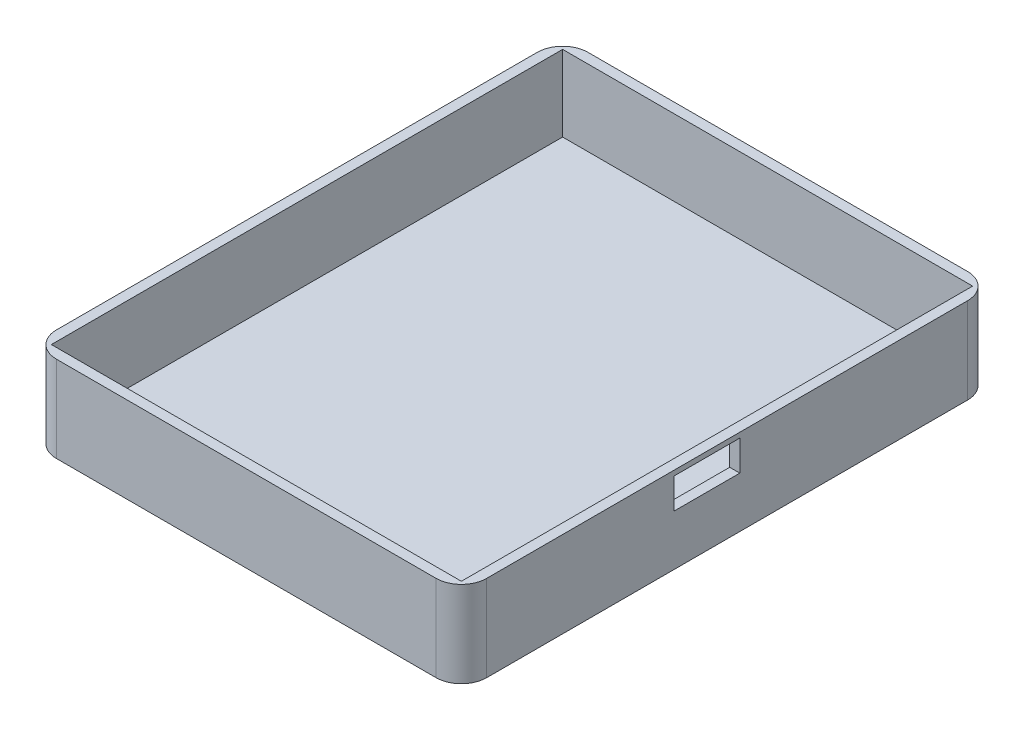
ISO-10303-21;
HEADER;
FILE_DESCRIPTION(('STEP AP214'),'2;1');
FILE_NAME('part.step','',(''),(''),'','','');
FILE_SCHEMA(('AUTOMOTIVE_DESIGN { 1 0 10303 214 1 1 1 1 }'));
ENDSEC;
DATA;
#1=APPLICATION_CONTEXT('core data for automotive mechanical design processes');
#2=APPLICATION_PROTOCOL_DEFINITION('international standard','automotive_design',2000,#1);
#3=PRODUCT_CONTEXT('',#1,'mechanical');
#4=PRODUCT('Part','Part','',(#3));
#5=PRODUCT_RELATED_PRODUCT_CATEGORY('part','',(#4));
#6=PRODUCT_DEFINITION_FORMATION('','',#4);
#7=PRODUCT_DEFINITION_CONTEXT('part definition',#1,'design');
#8=PRODUCT_DEFINITION('design','',#6,#7);
#9=PRODUCT_DEFINITION_SHAPE('','',#8);
#10=(LENGTH_UNIT() NAMED_UNIT(*) SI_UNIT(.MILLI.,.METRE.));
#11=(NAMED_UNIT(*) PLANE_ANGLE_UNIT() SI_UNIT($,.RADIAN.));
#12=(NAMED_UNIT(*) SI_UNIT($,.STERADIAN.) SOLID_ANGLE_UNIT());
#13=UNCERTAINTY_MEASURE_WITH_UNIT(LENGTH_MEASURE(1.E-05),#10,'distance_accuracy_value','');
#14=(GEOMETRIC_REPRESENTATION_CONTEXT(3) GLOBAL_UNCERTAINTY_ASSIGNED_CONTEXT((#13)) GLOBAL_UNIT_ASSIGNED_CONTEXT((#10,
#11,#12)) REPRESENTATION_CONTEXT('',''));
#15=CARTESIAN_POINT('',(0.,0.,0.));
#16=DIRECTION('',(0.,0.,1.));
#17=DIRECTION('',(1.,0.,0.));
#18=AXIS2_PLACEMENT_3D('',#15,#16,#17);
#19=CARTESIAN_POINT('',(0.,17.,0.));
#20=DIRECTION('',(0.,-1.,0.));
#21=DIRECTION('',(0.,0.,-1.));
#22=AXIS2_PLACEMENT_3D('',#19,#20,#21);
#23=PLANE('',#22);
#24=DIRECTION('',(-1.,0.,0.));
#25=VECTOR('',#24,1.);
#26=CARTESIAN_POINT('',(-42.5,17.,-52.5));
#27=LINE('',#26,#25);
#28=CARTESIAN_POINT('',(37.5,17.,-52.5));
#29=VERTEX_POINT('',#28);
#30=CARTESIAN_POINT('',(-37.5,17.,-52.5));
#31=VERTEX_POINT('',#30);
#32=EDGE_CURVE('E218',#29,#31,#27,.T.);
#33=ORIENTED_EDGE('',*,*,#32,.T.);
#34=CARTESIAN_POINT('',(-37.5,17.,-47.5));
#35=DIRECTION('',(0.,-1.,0.));
#36=DIRECTION('',(0.,0.,-1.));
#37=AXIS2_PLACEMENT_3D('',#34,#35,#36);
#38=CIRCLE('',#37,5.);
#39=CARTESIAN_POINT('',(-42.5,17.,-47.5));
#40=VERTEX_POINT('',#39);
#41=EDGE_CURVE('E265',#31,#40,#38,.F.);
#42=ORIENTED_EDGE('',*,*,#41,.T.);
#43=DIRECTION('',(0.,0.,1.));
#44=VECTOR('',#43,1.);
#45=CARTESIAN_POINT('',(-42.5,17.,52.5));
#46=LINE('',#45,#44);
#47=CARTESIAN_POINT('',(-42.5,17.,47.5));
#48=VERTEX_POINT('',#47);
#49=EDGE_CURVE('E222',#40,#48,#46,.T.);
#50=ORIENTED_EDGE('',*,*,#49,.T.);
#51=CARTESIAN_POINT('',(-37.5,17.,47.5));
#52=DIRECTION('',(0.,-1.,0.));
#53=DIRECTION('',(0.,0.,-1.));
#54=AXIS2_PLACEMENT_3D('',#51,#52,#53);
#55=CIRCLE('',#54,5.);
#56=CARTESIAN_POINT('',(-37.5,17.,52.5));
#57=VERTEX_POINT('',#56);
#58=EDGE_CURVE('E56',#48,#57,#55,.F.);
#59=ORIENTED_EDGE('',*,*,#58,.T.);
#60=DIRECTION('',(1.,0.,0.));
#61=VECTOR('',#60,1.);
#62=CARTESIAN_POINT('',(-42.5,17.,52.5));
#63=LINE('',#62,#61);
#64=CARTESIAN_POINT('',(37.5,17.,52.5));
#65=VERTEX_POINT('',#64);
#66=EDGE_CURVE('E224',#57,#65,#63,.T.);
#67=ORIENTED_EDGE('',*,*,#66,.T.);
#68=CARTESIAN_POINT('',(37.5,17.,47.5));
#69=DIRECTION('',(0.,-1.,0.));
#70=DIRECTION('',(0.,0.,-1.));
#71=AXIS2_PLACEMENT_3D('',#68,#69,#70);
#72=CIRCLE('',#71,5.);
#73=CARTESIAN_POINT('',(42.5,17.,47.5));
#74=VERTEX_POINT('',#73);
#75=EDGE_CURVE('E261',#65,#74,#72,.F.);
#76=ORIENTED_EDGE('',*,*,#75,.T.);
#77=DIRECTION('',(0.,0.,-1.));
#78=VECTOR('',#77,1.);
#79=CARTESIAN_POINT('',(42.5,17.,52.5));
#80=LINE('',#79,#78);
#81=CARTESIAN_POINT('',(42.5,17.,-47.5));
#82=VERTEX_POINT('',#81);
#83=EDGE_CURVE('E215',#74,#82,#80,.T.);
#84=ORIENTED_EDGE('',*,*,#83,.T.);
#85=CARTESIAN_POINT('',(37.5,17.,-47.5));
#86=DIRECTION('',(0.,-1.,0.));
#87=DIRECTION('',(0.,0.,-1.));
#88=AXIS2_PLACEMENT_3D('',#85,#86,#87);
#89=CIRCLE('',#88,5.);
#90=EDGE_CURVE('E263',#82,#29,#89,.F.);
#91=ORIENTED_EDGE('',*,*,#90,.T.);
#92=EDGE_LOOP('',(#33,#42,#50,#59,#67,#76,#84,#91));
#93=FACE_BOUND('',#92,.T.);
#94=DIRECTION('',(0.,0.,-1.));
#95=VECTOR('',#94,1.);
#96=CARTESIAN_POINT('',(40.5,17.,0.));
#97=LINE('',#96,#95);
#98=CARTESIAN_POINT('',(40.5,17.,50.5));
#99=VERTEX_POINT('',#98);
#100=CARTESIAN_POINT('',(40.5,17.,-50.5));
#101=VERTEX_POINT('',#100);
#102=EDGE_CURVE('E207',#99,#101,#97,.T.);
#103=ORIENTED_EDGE('',*,*,#102,.F.);
#104=DIRECTION('',(1.,0.,0.));
#105=VECTOR('',#104,1.);
#106=CARTESIAN_POINT('',(0.,17.,50.5));
#107=LINE('',#106,#105);
#108=CARTESIAN_POINT('',(-40.5,17.,50.5));
#109=VERTEX_POINT('',#108);
#110=EDGE_CURVE('E197',#109,#99,#107,.T.);
#111=ORIENTED_EDGE('',*,*,#110,.F.);
#112=DIRECTION('',(0.,0.,1.));
#113=VECTOR('',#112,1.);
#114=CARTESIAN_POINT('',(-40.5,17.,0.));
#115=LINE('',#114,#113);
#116=CARTESIAN_POINT('',(-40.5,17.,-50.5));
#117=VERTEX_POINT('',#116);
#118=EDGE_CURVE('E211',#117,#109,#115,.T.);
#119=ORIENTED_EDGE('',*,*,#118,.F.);
#120=DIRECTION('',(-1.,0.,0.));
#121=VECTOR('',#120,1.);
#122=CARTESIAN_POINT('',(0.,17.,-50.5));
#123=LINE('',#122,#121);
#124=EDGE_CURVE('E209',#101,#117,#123,.T.);
#125=ORIENTED_EDGE('',*,*,#124,.F.);
#126=EDGE_LOOP('',(#103,#111,#119,#125));
#127=FACE_BOUND('',#126,.T.);
#128=ADVANCED_FACE('F36',(#93,#127),#23,.F.);
#129=CARTESIAN_POINT('',(42.5,17.,52.5));
#130=DIRECTION('',(-1.,0.,0.));
#131=DIRECTION('',(0.,0.,1.));
#132=AXIS2_PLACEMENT_3D('',#129,#130,#131);
#133=PLANE('',#132);
#134=DIRECTION('',(0.,0.,1.));
#135=VECTOR('',#134,1.);
#136=CARTESIAN_POINT('',(42.5,16.,10.5));
#137=LINE('',#136,#135);
#138=CARTESIAN_POINT('',(42.5,16.,-2.5));
#139=VERTEX_POINT('',#138);
#140=CARTESIAN_POINT('',(42.5,16.,10.5));
#141=VERTEX_POINT('',#140);
#142=EDGE_CURVE('E165',#139,#141,#137,.T.);
#143=ORIENTED_EDGE('',*,*,#142,.F.);
#144=DIRECTION('',(0.,1.,0.));
#145=VECTOR('',#144,1.);
#146=CARTESIAN_POINT('',(42.5,10.,-2.5));
#147=LINE('',#146,#145);
#148=CARTESIAN_POINT('',(42.5,10.,-2.5));
#149=VERTEX_POINT('',#148);
#150=EDGE_CURVE('E170',#149,#139,#147,.T.);
#151=ORIENTED_EDGE('',*,*,#150,.F.);
#152=DIRECTION('',(0.,0.,-1.));
#153=VECTOR('',#152,1.);
#154=CARTESIAN_POINT('',(42.5,10.,10.5));
#155=LINE('',#154,#153);
#156=CARTESIAN_POINT('',(42.5,10.,10.5));
#157=VERTEX_POINT('',#156);
#158=EDGE_CURVE('E175',#157,#149,#155,.T.);
#159=ORIENTED_EDGE('',*,*,#158,.F.);
#160=DIRECTION('',(0.,-1.,0.));
#161=VECTOR('',#160,1.);
#162=CARTESIAN_POINT('',(42.5,10.,10.5));
#163=LINE('',#162,#161);
#164=EDGE_CURVE('E154',#141,#157,#163,.T.);
#165=ORIENTED_EDGE('',*,*,#164,.F.);
#166=EDGE_LOOP('',(#143,#151,#159,#165));
#167=FACE_BOUND('',#166,.T.);
#168=DIRECTION('',(0.,0.,-1.));
#169=VECTOR('',#168,1.);
#170=CARTESIAN_POINT('',(42.5,0.,52.5));
#171=LINE('',#170,#169);
#172=CARTESIAN_POINT('',(42.5,0.,47.5));
#173=VERTEX_POINT('',#172);
#174=CARTESIAN_POINT('',(42.5,0.,-47.5));
#175=VERTEX_POINT('',#174);
#176=EDGE_CURVE('E191',#173,#175,#171,.T.);
#177=ORIENTED_EDGE('',*,*,#176,.T.);
#178=DIRECTION('',(0.,-1.,0.));
#179=VECTOR('',#178,1.);
#180=CARTESIAN_POINT('',(42.5,17.,-47.5));
#181=LINE('',#180,#179);
#182=EDGE_CURVE('E270',#175,#82,#181,.F.);
#183=ORIENTED_EDGE('',*,*,#182,.T.);
#184=ORIENTED_EDGE('',*,*,#83,.F.);
#185=DIRECTION('',(0.,-1.,0.));
#186=VECTOR('',#185,1.);
#187=CARTESIAN_POINT('',(42.5,17.,47.5));
#188=LINE('',#187,#186);
#189=EDGE_CURVE('E267',#74,#173,#188,.T.);
#190=ORIENTED_EDGE('',*,*,#189,.T.);
#191=EDGE_LOOP('',(#177,#183,#184,#190));
#192=FACE_BOUND('',#191,.T.);
#193=ADVANCED_FACE('F172',(#167,#192),#133,.F.);
#194=CARTESIAN_POINT('',(-42.5,17.,-52.5));
#195=DIRECTION('',(0.,0.,1.));
#196=DIRECTION('',(1.,0.,0.));
#197=AXIS2_PLACEMENT_3D('',#194,#195,#196);
#198=PLANE('',#197);
#199=DIRECTION('',(-1.,0.,0.));
#200=VECTOR('',#199,1.);
#201=CARTESIAN_POINT('',(-42.5,0.,-52.5));
#202=LINE('',#201,#200);
#203=CARTESIAN_POINT('',(37.5,0.,-52.5));
#204=VERTEX_POINT('',#203);
#205=CARTESIAN_POINT('',(-37.5,0.,-52.5));
#206=VERTEX_POINT('',#205);
#207=EDGE_CURVE('E229',#204,#206,#202,.T.);
#208=ORIENTED_EDGE('',*,*,#207,.T.);
#209=DIRECTION('',(0.,-1.,0.));
#210=VECTOR('',#209,1.);
#211=CARTESIAN_POINT('',(-37.5,17.,-52.5));
#212=LINE('',#211,#210);
#213=EDGE_CURVE('E258',#206,#31,#212,.F.);
#214=ORIENTED_EDGE('',*,*,#213,.T.);
#215=ORIENTED_EDGE('',*,*,#32,.F.);
#216=DIRECTION('',(0.,-1.,0.));
#217=VECTOR('',#216,1.);
#218=CARTESIAN_POINT('',(37.5,17.,-52.5));
#219=LINE('',#218,#217);
#220=EDGE_CURVE('E255',#29,#204,#219,.T.);
#221=ORIENTED_EDGE('',*,*,#220,.T.);
#222=EDGE_LOOP('',(#208,#214,#215,#221));
#223=FACE_BOUND('',#222,.T.);
#224=ADVANCED_FACE('F294',(#223),#198,.F.);
#225=CARTESIAN_POINT('',(-42.5,17.,52.5));
#226=DIRECTION('',(1.,0.,0.));
#227=DIRECTION('',(0.,0.,-1.));
#228=AXIS2_PLACEMENT_3D('',#225,#226,#227);
#229=PLANE('',#228);
#230=ORIENTED_EDGE('',*,*,#49,.F.);
#231=DIRECTION('',(0.,-1.,0.));
#232=VECTOR('',#231,1.);
#233=CARTESIAN_POINT('',(-42.5,17.,-47.5));
#234=LINE('',#233,#232);
#235=CARTESIAN_POINT('',(-42.5,0.,-47.5));
#236=VERTEX_POINT('',#235);
#237=EDGE_CURVE('E244',#40,#236,#234,.T.);
#238=ORIENTED_EDGE('',*,*,#237,.T.);
#239=DIRECTION('',(0.,0.,1.));
#240=VECTOR('',#239,1.);
#241=CARTESIAN_POINT('',(-42.5,0.,52.5));
#242=LINE('',#241,#240);
#243=CARTESIAN_POINT('',(-42.5,0.,47.5));
#244=VERTEX_POINT('',#243);
#245=EDGE_CURVE('E232',#236,#244,#242,.T.);
#246=ORIENTED_EDGE('',*,*,#245,.T.);
#247=DIRECTION('',(0.,-1.,0.));
#248=VECTOR('',#247,1.);
#249=CARTESIAN_POINT('',(-42.5,17.,47.5));
#250=LINE('',#249,#248);
#251=EDGE_CURVE('E242',#244,#48,#250,.F.);
#252=ORIENTED_EDGE('',*,*,#251,.T.);
#253=EDGE_LOOP('',(#230,#238,#246,#252));
#254=FACE_BOUND('',#253,.T.);
#255=ADVANCED_FACE('F302',(#254),#229,.F.);
#256=CARTESIAN_POINT('',(-42.5,17.,52.5));
#257=DIRECTION('',(0.,0.,-1.));
#258=DIRECTION('',(-1.,0.,0.));
#259=AXIS2_PLACEMENT_3D('',#256,#257,#258);
#260=PLANE('',#259);
#261=DIRECTION('',(1.,0.,0.));
#262=VECTOR('',#261,1.);
#263=CARTESIAN_POINT('',(-42.5,0.,52.5));
#264=LINE('',#263,#262);
#265=CARTESIAN_POINT('',(-37.5,0.,52.5));
#266=VERTEX_POINT('',#265);
#267=CARTESIAN_POINT('',(37.5,0.,52.5));
#268=VERTEX_POINT('',#267);
#269=EDGE_CURVE('E219',#266,#268,#264,.T.);
#270=ORIENTED_EDGE('',*,*,#269,.T.);
#271=DIRECTION('',(0.,-1.,0.));
#272=VECTOR('',#271,1.);
#273=CARTESIAN_POINT('',(37.5,17.,52.5));
#274=LINE('',#273,#272);
#275=EDGE_CURVE('E11',#268,#65,#274,.F.);
#276=ORIENTED_EDGE('',*,*,#275,.T.);
#277=ORIENTED_EDGE('',*,*,#66,.F.);
#278=DIRECTION('',(0.,-1.,0.));
#279=VECTOR('',#278,1.);
#280=CARTESIAN_POINT('',(-37.5,17.,52.5));
#281=LINE('',#280,#279);
#282=EDGE_CURVE('E44',#57,#266,#281,.T.);
#283=ORIENTED_EDGE('',*,*,#282,.T.);
#284=EDGE_LOOP('',(#270,#276,#277,#283));
#285=FACE_BOUND('',#284,.T.);
#286=ADVANCED_FACE('F274',(#285),#260,.F.);
#287=CARTESIAN_POINT('',(0.,0.,0.));
#288=DIRECTION('',(0.,-1.,0.));
#289=DIRECTION('',(0.,0.,-1.));
#290=AXIS2_PLACEMENT_3D('',#287,#288,#289);
#291=PLANE('',#290);
#292=ORIENTED_EDGE('',*,*,#245,.F.);
#293=CARTESIAN_POINT('',(-37.5,0.,-47.5));
#294=DIRECTION('',(0.,-1.,0.));
#295=DIRECTION('',(0.,0.,-1.));
#296=AXIS2_PLACEMENT_3D('',#293,#294,#295);
#297=CIRCLE('',#296,5.);
#298=EDGE_CURVE('E253',#236,#206,#297,.T.);
#299=ORIENTED_EDGE('',*,*,#298,.T.);
#300=ORIENTED_EDGE('',*,*,#207,.F.);
#301=CARTESIAN_POINT('',(37.5,0.,-47.5));
#302=DIRECTION('',(0.,-1.,0.));
#303=DIRECTION('',(0.,0.,-1.));
#304=AXIS2_PLACEMENT_3D('',#301,#302,#303);
#305=CIRCLE('',#304,5.);
#306=EDGE_CURVE('E251',#204,#175,#305,.T.);
#307=ORIENTED_EDGE('',*,*,#306,.T.);
#308=ORIENTED_EDGE('',*,*,#176,.F.);
#309=CARTESIAN_POINT('',(37.5,0.,47.5));
#310=DIRECTION('',(0.,-1.,0.));
#311=DIRECTION('',(0.,0.,-1.));
#312=AXIS2_PLACEMENT_3D('',#309,#310,#311);
#313=CIRCLE('',#312,5.);
#314=EDGE_CURVE('E249',#173,#268,#313,.T.);
#315=ORIENTED_EDGE('',*,*,#314,.T.);
#316=ORIENTED_EDGE('',*,*,#269,.F.);
#317=CARTESIAN_POINT('',(-37.5,0.,47.5));
#318=DIRECTION('',(0.,-1.,0.));
#319=DIRECTION('',(0.,0.,-1.));
#320=AXIS2_PLACEMENT_3D('',#317,#318,#319);
#321=CIRCLE('',#320,5.);
#322=EDGE_CURVE('E247',#266,#244,#321,.T.);
#323=ORIENTED_EDGE('',*,*,#322,.T.);
#324=EDGE_LOOP('',(#292,#299,#300,#307,#308,#315,#316,#323));
#325=FACE_BOUND('',#324,.T.);
#326=ADVANCED_FACE('F278',(#325),#291,.T.);
#327=CARTESIAN_POINT('',(40.5,17.,52.5));
#328=DIRECTION('',(-1.,0.,0.));
#329=DIRECTION('',(0.,0.,1.));
#330=AXIS2_PLACEMENT_3D('',#327,#328,#329);
#331=PLANE('',#330);
#332=DIRECTION('',(0.,-1.,0.));
#333=VECTOR('',#332,1.);
#334=CARTESIAN_POINT('',(40.5,17.,-2.5));
#335=LINE('',#334,#333);
#336=CARTESIAN_POINT('',(40.5,16.,-2.5));
#337=VERTEX_POINT('',#336);
#338=CARTESIAN_POINT('',(40.5,10.,-2.5));
#339=VERTEX_POINT('',#338);
#340=EDGE_CURVE('E240',#337,#339,#335,.T.);
#341=ORIENTED_EDGE('',*,*,#340,.F.);
#342=DIRECTION('',(0.,0.,-1.));
#343=VECTOR('',#342,1.);
#344=CARTESIAN_POINT('',(40.5,16.,52.5));
#345=LINE('',#344,#343);
#346=CARTESIAN_POINT('',(40.5,16.,10.5));
#347=VERTEX_POINT('',#346);
#348=EDGE_CURVE('E226',#347,#337,#345,.T.);
#349=ORIENTED_EDGE('',*,*,#348,.F.);
#350=DIRECTION('',(0.,1.,0.));
#351=VECTOR('',#350,1.);
#352=CARTESIAN_POINT('',(40.5,17.,10.5));
#353=LINE('',#352,#351);
#354=CARTESIAN_POINT('',(40.5,10.,10.5));
#355=VERTEX_POINT('',#354);
#356=EDGE_CURVE('E157',#355,#347,#353,.T.);
#357=ORIENTED_EDGE('',*,*,#356,.F.);
#358=DIRECTION('',(0.,0.,1.));
#359=VECTOR('',#358,1.);
#360=CARTESIAN_POINT('',(40.5,10.,52.5));
#361=LINE('',#360,#359);
#362=EDGE_CURVE('E238',#339,#355,#361,.T.);
#363=ORIENTED_EDGE('',*,*,#362,.F.);
#364=EDGE_LOOP('',(#341,#349,#357,#363));
#365=FACE_BOUND('',#364,.T.);
#366=DIRECTION('',(0.,0.,-1.));
#367=VECTOR('',#366,1.);
#368=CARTESIAN_POINT('',(40.5,2.,0.));
#369=LINE('',#368,#367);
#370=CARTESIAN_POINT('',(40.5,2.,50.5));
#371=VERTEX_POINT('',#370);
#372=CARTESIAN_POINT('',(40.5,2.,-50.5));
#373=VERTEX_POINT('',#372);
#374=EDGE_CURVE('E182',#371,#373,#369,.T.);
#375=ORIENTED_EDGE('',*,*,#374,.F.);
#376=DIRECTION('',(0.,-1.,0.));
#377=VECTOR('',#376,1.);
#378=CARTESIAN_POINT('',(40.5,17.,50.5));
#379=LINE('',#378,#377);
#380=EDGE_CURVE('E193',#99,#371,#379,.T.);
#381=ORIENTED_EDGE('',*,*,#380,.F.);
#382=ORIENTED_EDGE('',*,*,#102,.T.);
#383=DIRECTION('',(0.,-1.,0.));
#384=VECTOR('',#383,1.);
#385=CARTESIAN_POINT('',(40.5,17.,-50.5));
#386=LINE('',#385,#384);
#387=EDGE_CURVE('E188',#101,#373,#386,.T.);
#388=ORIENTED_EDGE('',*,*,#387,.T.);
#389=EDGE_LOOP('',(#375,#381,#382,#388));
#390=FACE_BOUND('',#389,.T.);
#391=ADVANCED_FACE('F320',(#365,#390),#331,.T.);
#392=CARTESIAN_POINT('',(-42.5,17.,-50.5));
#393=DIRECTION('',(0.,0.,1.));
#394=DIRECTION('',(1.,0.,0.));
#395=AXIS2_PLACEMENT_3D('',#392,#393,#394);
#396=PLANE('',#395);
#397=DIRECTION('',(-1.,0.,0.));
#398=VECTOR('',#397,1.);
#399=CARTESIAN_POINT('',(0.,2.,-50.5));
#400=LINE('',#399,#398);
#401=CARTESIAN_POINT('',(-40.5,2.,-50.5));
#402=VERTEX_POINT('',#401);
#403=EDGE_CURVE('E187',#373,#402,#400,.T.);
#404=ORIENTED_EDGE('',*,*,#403,.F.);
#405=ORIENTED_EDGE('',*,*,#387,.F.);
#406=ORIENTED_EDGE('',*,*,#124,.T.);
#407=DIRECTION('',(0.,-1.,0.));
#408=VECTOR('',#407,1.);
#409=CARTESIAN_POINT('',(-40.5,17.,-50.5));
#410=LINE('',#409,#408);
#411=EDGE_CURVE('E192',#117,#402,#410,.T.);
#412=ORIENTED_EDGE('',*,*,#411,.T.);
#413=EDGE_LOOP('',(#404,#405,#406,#412));
#414=FACE_BOUND('',#413,.T.);
#415=ADVANCED_FACE('F408',(#414),#396,.T.);
#416=CARTESIAN_POINT('',(-40.5,17.,52.5));
#417=DIRECTION('',(1.,0.,0.));
#418=DIRECTION('',(0.,0.,-1.));
#419=AXIS2_PLACEMENT_3D('',#416,#417,#418);
#420=PLANE('',#419);
#421=DIRECTION('',(0.,0.,1.));
#422=VECTOR('',#421,1.);
#423=CARTESIAN_POINT('',(-40.5,2.,0.));
#424=LINE('',#423,#422);
#425=CARTESIAN_POINT('',(-40.5,2.,50.5));
#426=VERTEX_POINT('',#425);
#427=EDGE_CURVE('E199',#402,#426,#424,.T.);
#428=ORIENTED_EDGE('',*,*,#427,.F.);
#429=ORIENTED_EDGE('',*,*,#411,.F.);
#430=ORIENTED_EDGE('',*,*,#118,.T.);
#431=DIRECTION('',(0.,-1.,0.));
#432=VECTOR('',#431,1.);
#433=CARTESIAN_POINT('',(-40.5,17.,50.5));
#434=LINE('',#433,#432);
#435=EDGE_CURVE('E196',#109,#426,#434,.T.);
#436=ORIENTED_EDGE('',*,*,#435,.T.);
#437=EDGE_LOOP('',(#428,#429,#430,#436));
#438=FACE_BOUND('',#437,.T.);
#439=ADVANCED_FACE('F400',(#438),#420,.T.);
#440=CARTESIAN_POINT('',(-42.5,17.,50.5));
#441=DIRECTION('',(0.,0.,-1.));
#442=DIRECTION('',(-1.,0.,0.));
#443=AXIS2_PLACEMENT_3D('',#440,#441,#442);
#444=PLANE('',#443);
#445=DIRECTION('',(1.,0.,0.));
#446=VECTOR('',#445,1.);
#447=CARTESIAN_POINT('',(0.,2.,50.5));
#448=LINE('',#447,#446);
#449=EDGE_CURVE('E203',#426,#371,#448,.T.);
#450=ORIENTED_EDGE('',*,*,#449,.F.);
#451=ORIENTED_EDGE('',*,*,#435,.F.);
#452=ORIENTED_EDGE('',*,*,#110,.T.);
#453=ORIENTED_EDGE('',*,*,#380,.T.);
#454=EDGE_LOOP('',(#450,#451,#452,#453));
#455=FACE_BOUND('',#454,.T.);
#456=ADVANCED_FACE('F392',(#455),#444,.T.);
#457=CARTESIAN_POINT('',(0.,2.,0.));
#458=DIRECTION('',(0.,-1.,0.));
#459=DIRECTION('',(0.,0.,-1.));
#460=AXIS2_PLACEMENT_3D('',#457,#458,#459);
#461=PLANE('',#460);
#462=ORIENTED_EDGE('',*,*,#374,.T.);
#463=ORIENTED_EDGE('',*,*,#403,.T.);
#464=ORIENTED_EDGE('',*,*,#427,.T.);
#465=ORIENTED_EDGE('',*,*,#449,.T.);
#466=EDGE_LOOP('',(#462,#463,#464,#465));
#467=FACE_BOUND('',#466,.T.);
#468=ADVANCED_FACE('F316',(#467),#461,.F.);
#469=CARTESIAN_POINT('',(32.5,10.,-2.5));
#470=DIRECTION('',(0.,0.,-1.));
#471=DIRECTION('',(-1.,0.,0.));
#472=AXIS2_PLACEMENT_3D('',#469,#470,#471);
#473=PLANE('',#472);
#474=ORIENTED_EDGE('',*,*,#340,.T.);
#475=DIRECTION('',(1.,0.,0.));
#476=VECTOR('',#475,1.);
#477=CARTESIAN_POINT('',(32.5,10.,-2.5));
#478=LINE('',#477,#476);
#479=EDGE_CURVE('E180',#339,#149,#478,.T.);
#480=ORIENTED_EDGE('',*,*,#479,.T.);
#481=ORIENTED_EDGE('',*,*,#150,.T.);
#482=DIRECTION('',(1.,0.,0.));
#483=VECTOR('',#482,1.);
#484=CARTESIAN_POINT('',(32.5,16.,-2.5));
#485=LINE('',#484,#483);
#486=EDGE_CURVE('E161',#337,#139,#485,.T.);
#487=ORIENTED_EDGE('',*,*,#486,.F.);
#488=EDGE_LOOP('',(#474,#480,#481,#487));
#489=FACE_BOUND('',#488,.T.);
#490=ADVANCED_FACE('F374',(#489),#473,.F.);
#491=CARTESIAN_POINT('',(32.5,10.,10.5));
#492=DIRECTION('',(0.,-1.,0.));
#493=DIRECTION('',(0.,0.,-1.));
#494=AXIS2_PLACEMENT_3D('',#491,#492,#493);
#495=PLANE('',#494);
#496=ORIENTED_EDGE('',*,*,#362,.T.);
#497=DIRECTION('',(1.,0.,0.));
#498=VECTOR('',#497,1.);
#499=CARTESIAN_POINT('',(32.5,10.,10.5));
#500=LINE('',#499,#498);
#501=EDGE_CURVE('E160',#355,#157,#500,.T.);
#502=ORIENTED_EDGE('',*,*,#501,.T.);
#503=ORIENTED_EDGE('',*,*,#158,.T.);
#504=ORIENTED_EDGE('',*,*,#479,.F.);
#505=EDGE_LOOP('',(#496,#502,#503,#504));
#506=FACE_BOUND('',#505,.T.);
#507=ADVANCED_FACE('F366',(#506),#495,.F.);
#508=CARTESIAN_POINT('',(32.5,10.,10.5));
#509=DIRECTION('',(0.,0.,1.));
#510=DIRECTION('',(1.,0.,0.));
#511=AXIS2_PLACEMENT_3D('',#508,#509,#510);
#512=PLANE('',#511);
#513=ORIENTED_EDGE('',*,*,#356,.T.);
#514=DIRECTION('',(1.,0.,0.));
#515=VECTOR('',#514,1.);
#516=CARTESIAN_POINT('',(32.5,16.,10.5));
#517=LINE('',#516,#515);
#518=EDGE_CURVE('E149',#347,#141,#517,.T.);
#519=ORIENTED_EDGE('',*,*,#518,.T.);
#520=ORIENTED_EDGE('',*,*,#164,.T.);
#521=ORIENTED_EDGE('',*,*,#501,.F.);
#522=EDGE_LOOP('',(#513,#519,#520,#521));
#523=FACE_BOUND('',#522,.T.);
#524=ADVANCED_FACE('F151',(#523),#512,.F.);
#525=CARTESIAN_POINT('',(32.5,16.,10.5));
#526=DIRECTION('',(0.,1.,0.));
#527=DIRECTION('',(0.,0.,1.));
#528=AXIS2_PLACEMENT_3D('',#525,#526,#527);
#529=PLANE('',#528);
#530=ORIENTED_EDGE('',*,*,#348,.T.);
#531=ORIENTED_EDGE('',*,*,#486,.T.);
#532=ORIENTED_EDGE('',*,*,#142,.T.);
#533=ORIENTED_EDGE('',*,*,#518,.F.);
#534=EDGE_LOOP('',(#530,#531,#532,#533));
#535=FACE_BOUND('',#534,.T.);
#536=ADVANCED_FACE('F166',(#535),#529,.F.);
#537=CARTESIAN_POINT('',(-37.5,17.,-47.5));
#538=DIRECTION('',(0.,-1.,0.));
#539=DIRECTION('',(0.,0.,-1.));
#540=AXIS2_PLACEMENT_3D('',#537,#538,#539);
#541=CYLINDRICAL_SURFACE('',#540,5.);
#542=ORIENTED_EDGE('',*,*,#41,.F.);
#543=ORIENTED_EDGE('',*,*,#213,.F.);
#544=ORIENTED_EDGE('',*,*,#298,.F.);
#545=ORIENTED_EDGE('',*,*,#237,.F.);
#546=EDGE_LOOP('',(#542,#543,#544,#545));
#547=FACE_BOUND('',#546,.T.);
#548=ADVANCED_FACE('F299',(#547),#541,.T.);
#549=CARTESIAN_POINT('',(37.5,17.,-47.5));
#550=DIRECTION('',(0.,-1.,0.));
#551=DIRECTION('',(0.,0.,-1.));
#552=AXIS2_PLACEMENT_3D('',#549,#550,#551);
#553=CYLINDRICAL_SURFACE('',#552,5.);
#554=ORIENTED_EDGE('',*,*,#90,.F.);
#555=ORIENTED_EDGE('',*,*,#182,.F.);
#556=ORIENTED_EDGE('',*,*,#306,.F.);
#557=ORIENTED_EDGE('',*,*,#220,.F.);
#558=EDGE_LOOP('',(#554,#555,#556,#557));
#559=FACE_BOUND('',#558,.T.);
#560=ADVANCED_FACE('F291',(#559),#553,.T.);
#561=CARTESIAN_POINT('',(37.5,17.,47.5));
#562=DIRECTION('',(0.,-1.,0.));
#563=DIRECTION('',(0.,0.,-1.));
#564=AXIS2_PLACEMENT_3D('',#561,#562,#563);
#565=CYLINDRICAL_SURFACE('',#564,5.);
#566=ORIENTED_EDGE('',*,*,#75,.F.);
#567=ORIENTED_EDGE('',*,*,#275,.F.);
#568=ORIENTED_EDGE('',*,*,#314,.F.);
#569=ORIENTED_EDGE('',*,*,#189,.F.);
#570=EDGE_LOOP('',(#566,#567,#568,#569));
#571=FACE_BOUND('',#570,.T.);
#572=ADVANCED_FACE('F283',(#571),#565,.T.);
#573=CARTESIAN_POINT('',(-37.5,17.,47.5));
#574=DIRECTION('',(0.,-1.,0.));
#575=DIRECTION('',(0.,0.,-1.));
#576=AXIS2_PLACEMENT_3D('',#573,#574,#575);
#577=CYLINDRICAL_SURFACE('',#576,5.);
#578=ORIENTED_EDGE('',*,*,#58,.F.);
#579=ORIENTED_EDGE('',*,*,#251,.F.);
#580=ORIENTED_EDGE('',*,*,#322,.F.);
#581=ORIENTED_EDGE('',*,*,#282,.F.);
#582=EDGE_LOOP('',(#578,#579,#580,#581));
#583=FACE_BOUND('',#582,.T.);
#584=ADVANCED_FACE('F38',(#583),#577,.T.);
#585=CLOSED_SHELL('',(#128,#193,#224,#255,#286,#326,#391,#415,#439,#456,#468,#490,#507,#524,
#536,#548,#560,#572,#584));
#586=MANIFOLD_SOLID_BREP('B2',#585);
#587=ADVANCED_BREP_SHAPE_REPRESENTATION('',(#18,#586),#14);
#588=SHAPE_DEFINITION_REPRESENTATION(#9,#587);
ENDSEC;
END-ISO-10303-21;
